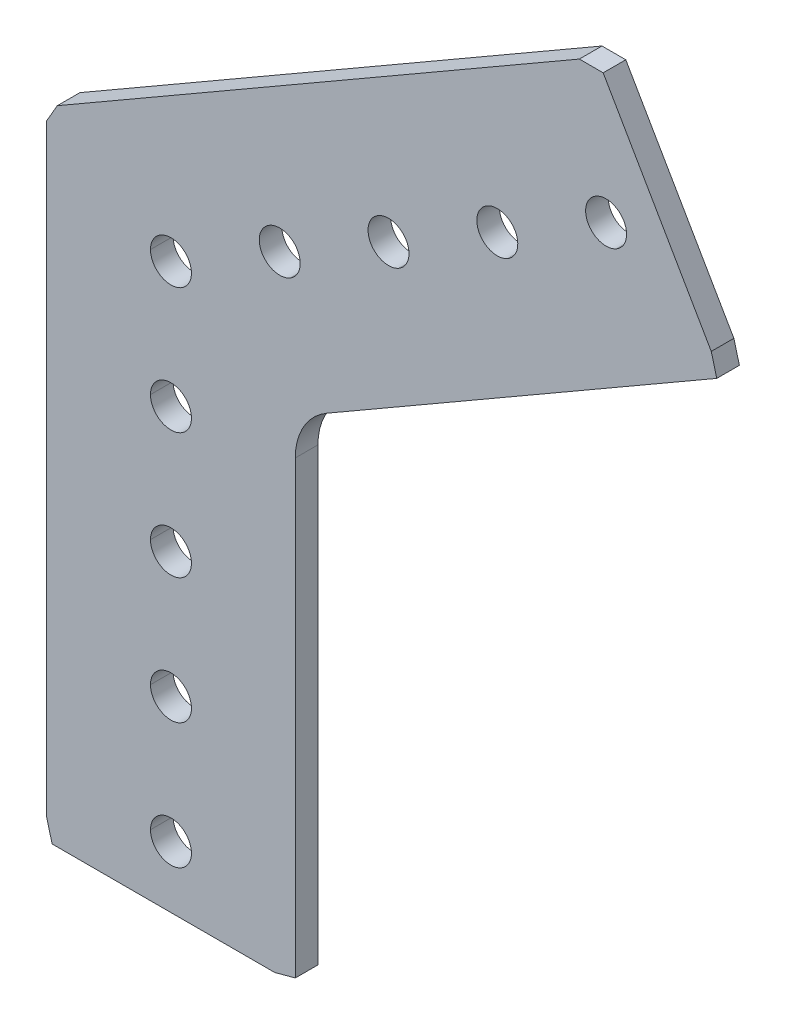
ISO-10303-21;
HEADER;
FILE_DESCRIPTION(('STEP AP214'),'2;1');
FILE_NAME('part.step','',(''),(''),'','','');
FILE_SCHEMA(('AUTOMOTIVE_DESIGN { 1 0 10303 214 1 1 1 1 }'));
ENDSEC;
DATA;
#1=APPLICATION_CONTEXT('core data for automotive mechanical design processes');
#2=APPLICATION_PROTOCOL_DEFINITION('international standard','automotive_design',2000,#1);
#3=PRODUCT_CONTEXT('',#1,'mechanical');
#4=PRODUCT('Part','Part','',(#3));
#5=PRODUCT_RELATED_PRODUCT_CATEGORY('part','',(#4));
#6=PRODUCT_DEFINITION_FORMATION('','',#4);
#7=PRODUCT_DEFINITION_CONTEXT('part definition',#1,'design');
#8=PRODUCT_DEFINITION('design','',#6,#7);
#9=PRODUCT_DEFINITION_SHAPE('','',#8);
#10=(LENGTH_UNIT() NAMED_UNIT(*) SI_UNIT(.MILLI.,.METRE.));
#11=(NAMED_UNIT(*) PLANE_ANGLE_UNIT() SI_UNIT($,.RADIAN.));
#12=(NAMED_UNIT(*) SI_UNIT($,.STERADIAN.) SOLID_ANGLE_UNIT());
#13=UNCERTAINTY_MEASURE_WITH_UNIT(LENGTH_MEASURE(1.E-05),#10,'distance_accuracy_value','');
#14=(GEOMETRIC_REPRESENTATION_CONTEXT(3) GLOBAL_UNCERTAINTY_ASSIGNED_CONTEXT((#13)) GLOBAL_UNIT_ASSIGNED_CONTEXT((#10,
#11,#12)) REPRESENTATION_CONTEXT('',''));
#15=CARTESIAN_POINT('',(0.,0.,0.));
#16=DIRECTION('',(0.,0.,1.));
#17=DIRECTION('',(1.,0.,0.));
#18=AXIS2_PLACEMENT_3D('',#15,#16,#17);
#19=CARTESIAN_POINT('',(-12.573,-54.9375661410419,2.286));
#20=DIRECTION('',(0.965925826289068,0.258819045102523,0.));
#21=DIRECTION('',(0.,0.,-1.));
#22=AXIS2_PLACEMENT_3D('',#19,#20,#21);
#23=PLANE('',#22);
#24=DIRECTION('',(-0.258819045102523,0.965925826289068,0.));
#25=VECTOR('',#24,1.);
#26=CARTESIAN_POINT('',(-12.573,-54.9375661410419,2.286));
#27=LINE('',#26,#25);
#28=CARTESIAN_POINT('',(-12.0142096816237,-57.023,2.286));
#29=VERTEX_POINT('',#28);
#30=CARTESIAN_POINT('',(-12.573,-54.9375661410419,2.286));
#31=VERTEX_POINT('',#30);
#32=EDGE_CURVE('E267',#29,#31,#27,.T.);
#33=ORIENTED_EDGE('',*,*,#32,.T.);
#34=DIRECTION('',(0.,0.,-1.));
#35=VECTOR('',#34,1.);
#36=CARTESIAN_POINT('',(-12.573,-54.9375661410419,2.286));
#37=LINE('',#36,#35);
#38=CARTESIAN_POINT('',(-12.573,-54.9375661410419,0.));
#39=VERTEX_POINT('',#38);
#40=EDGE_CURVE('E501',#31,#39,#37,.T.);
#41=ORIENTED_EDGE('',*,*,#40,.T.);
#42=DIRECTION('',(-0.258819045102523,0.965925826289068,0.));
#43=VECTOR('',#42,1.);
#44=CARTESIAN_POINT('',(-12.573,-54.9375661410419,0.));
#45=LINE('',#44,#43);
#46=CARTESIAN_POINT('',(-12.0142096816237,-57.023,0.));
#47=VERTEX_POINT('',#46);
#48=EDGE_CURVE('E328',#47,#39,#45,.T.);
#49=ORIENTED_EDGE('',*,*,#48,.F.);
#50=DIRECTION('',(0.,0.,-1.));
#51=VECTOR('',#50,1.);
#52=CARTESIAN_POINT('',(-12.0142096816237,-57.023,2.286));
#53=LINE('',#52,#51);
#54=EDGE_CURVE('E253',#29,#47,#53,.T.);
#55=ORIENTED_EDGE('',*,*,#54,.F.);
#56=EDGE_LOOP('',(#33,#41,#49,#55));
#57=FACE_BOUND('',#56,.T.);
#58=ADVANCED_FACE('F14',(#57),#23,.F.);
#59=CARTESIAN_POINT('',(54.6271496705208,19.4290012979886,2.286));
#60=DIRECTION('',(-0.965925826289067,-0.258819045102525,0.));
#61=DIRECTION('',(-0.258819045102525,0.965925826289067,0.));
#62=AXIS2_PLACEMENT_3D('',#59,#60,#61);
#63=PLANE('',#62);
#64=DIRECTION('',(0.258819045102525,-0.965925826289067,0.));
#65=VECTOR('',#64,1.);
#66=CARTESIAN_POINT('',(54.6271496705208,19.4290012979886,2.286));
#67=LINE('',#66,#65);
#68=CARTESIAN_POINT('',(54.6271496705208,19.4290012979886,2.286));
#69=VERTEX_POINT('',#68);
#70=CARTESIAN_POINT('',(55.1859399888972,17.3435674390306,2.286));
#71=VERTEX_POINT('',#70);
#72=EDGE_CURVE('E473',#69,#71,#67,.T.);
#73=ORIENTED_EDGE('',*,*,#72,.T.);
#74=DIRECTION('',(0.,0.,-1.));
#75=VECTOR('',#74,1.);
#76=CARTESIAN_POINT('',(55.1859399888972,17.3435674390306,2.286));
#77=LINE('',#76,#75);
#78=CARTESIAN_POINT('',(55.1859399888972,17.3435674390306,0.));
#79=VERTEX_POINT('',#78);
#80=EDGE_CURVE('E305',#71,#79,#77,.T.);
#81=ORIENTED_EDGE('',*,*,#80,.T.);
#82=DIRECTION('',(0.258819045102525,-0.965925826289067,0.));
#83=VECTOR('',#82,1.);
#84=CARTESIAN_POINT('',(54.6271496705208,19.4290012979886,0.));
#85=LINE('',#84,#83);
#86=CARTESIAN_POINT('',(54.6271496705208,19.4290012979886,0.));
#87=VERTEX_POINT('',#86);
#88=EDGE_CURVE('E376',#87,#79,#85,.T.);
#89=ORIENTED_EDGE('',*,*,#88,.F.);
#90=DIRECTION('',(0.,0.,-1.));
#91=VECTOR('',#90,1.);
#92=CARTESIAN_POINT('',(54.6271496705208,19.4290012979886,2.286));
#93=LINE('',#92,#91);
#94=EDGE_CURVE('E252',#69,#87,#93,.T.);
#95=ORIENTED_EDGE('',*,*,#94,.F.);
#96=EDGE_LOOP('',(#73,#81,#89,#95));
#97=FACE_BOUND('',#96,.T.);
#98=ADVANCED_FACE('F614',(#97),#63,.F.);
#99=CARTESIAN_POINT('',(41.2908279002298,38.3573204723031,2.286));
#100=DIRECTION('',(0.,-1.,0.));
#101=DIRECTION('',(0.,0.,-1.));
#102=AXIS2_PLACEMENT_3D('',#99,#100,#101);
#103=PLANE('',#102);
#104=DIRECTION('',(1.,0.,0.));
#105=VECTOR('',#104,1.);
#106=CARTESIAN_POINT('',(41.2908279002298,38.3573204723031,2.286));
#107=LINE('',#106,#105);
#108=CARTESIAN_POINT('',(41.2908279002298,38.3573204723031,2.286));
#109=VERTEX_POINT('',#108);
#110=CARTESIAN_POINT('',(43.6988794999231,38.3573204723031,2.286));
#111=VERTEX_POINT('',#110);
#112=EDGE_CURVE('E296',#109,#111,#107,.T.);
#113=ORIENTED_EDGE('',*,*,#112,.T.);
#114=DIRECTION('',(0.,0.,-1.));
#115=VECTOR('',#114,1.);
#116=CARTESIAN_POINT('',(43.6988794999231,38.3573204723031,2.286));
#117=LINE('',#116,#115);
#118=CARTESIAN_POINT('',(43.6988794999231,38.3573204723031,0.));
#119=VERTEX_POINT('',#118);
#120=EDGE_CURVE('E309',#111,#119,#117,.T.);
#121=ORIENTED_EDGE('',*,*,#120,.T.);
#122=DIRECTION('',(1.,0.,0.));
#123=VECTOR('',#122,1.);
#124=CARTESIAN_POINT('',(0.,38.3573204723031,0.));
#125=LINE('',#124,#123);
#126=CARTESIAN_POINT('',(41.2908279002298,38.3573204723031,0.));
#127=VERTEX_POINT('',#126);
#128=EDGE_CURVE('E342',#127,#119,#125,.T.);
#129=ORIENTED_EDGE('',*,*,#128,.F.);
#130=DIRECTION('',(0.,0.,-1.));
#131=VECTOR('',#130,1.);
#132=CARTESIAN_POINT('',(41.2908279002298,38.3573204723031,2.286));
#133=LINE('',#132,#131);
#134=EDGE_CURVE('E456',#109,#127,#133,.T.);
#135=ORIENTED_EDGE('',*,*,#134,.F.);
#136=EDGE_LOOP('',(#113,#121,#129,#135));
#137=FACE_BOUND('',#136,.T.);
#138=ADVANCED_FACE('F752',(#137),#103,.F.);
#139=CARTESIAN_POINT('',(-12.573,6.01252570334088,2.286));
#140=DIRECTION('',(0.866025403784439,-0.5,0.));
#141=DIRECTION('',(0.,0.,-1.));
#142=AXIS2_PLACEMENT_3D('',#139,#140,#141);
#143=PLANE('',#142);
#144=DIRECTION('',(0.5,0.866025403784439,0.));
#145=VECTOR('',#144,1.);
#146=CARTESIAN_POINT('',(-12.573,6.01252570334088,2.286));
#147=LINE('',#146,#145);
#148=CARTESIAN_POINT('',(-12.573,6.01252570334088,2.286));
#149=VERTEX_POINT('',#148);
#150=CARTESIAN_POINT('',(-11.4935,7.88227455011124,2.286));
#151=VERTEX_POINT('',#150);
#152=EDGE_CURVE('E295',#149,#151,#147,.T.);
#153=ORIENTED_EDGE('',*,*,#152,.T.);
#154=DIRECTION('',(0.,0.,-1.));
#155=VECTOR('',#154,1.);
#156=CARTESIAN_POINT('',(-11.4935,7.88227455011131,2.286));
#157=LINE('',#156,#155);
#158=CARTESIAN_POINT('',(-11.4935,7.88227455011131,0.));
#159=VERTEX_POINT('',#158);
#160=EDGE_CURVE('E498',#151,#159,#157,.T.);
#161=ORIENTED_EDGE('',*,*,#160,.T.);
#162=DIRECTION('',(0.5,0.866025403784439,0.));
#163=VECTOR('',#162,1.);
#164=CARTESIAN_POINT('',(-12.573,6.01252570334088,0.));
#165=LINE('',#164,#163);
#166=CARTESIAN_POINT('',(-12.573,6.01252570334088,0.));
#167=VERTEX_POINT('',#166);
#168=EDGE_CURVE('E343',#167,#159,#165,.T.);
#169=ORIENTED_EDGE('',*,*,#168,.F.);
#170=DIRECTION('',(0.,0.,-1.));
#171=VECTOR('',#170,1.);
#172=CARTESIAN_POINT('',(-12.573,6.01252570334088,2.286));
#173=LINE('',#172,#171);
#174=EDGE_CURVE('E18',#149,#167,#173,.T.);
#175=ORIENTED_EDGE('',*,*,#174,.F.);
#176=EDGE_LOOP('',(#153,#161,#169,#175));
#177=FACE_BOUND('',#176,.T.);
#178=ADVANCED_FACE('F747',(#177),#143,.F.);
#179=CARTESIAN_POINT('',(10.4875661410419,-57.023,2.286));
#180=DIRECTION('',(-0.258819045102521,0.965925826289068,0.));
#181=DIRECTION('',(0.,0.,1.));
#182=AXIS2_PLACEMENT_3D('',#179,#180,#181);
#183=PLANE('',#182);
#184=DIRECTION('',(-0.965925826289068,-0.258819045102521,0.));
#185=VECTOR('',#184,1.);
#186=CARTESIAN_POINT('',(10.4875661410419,-57.023,2.286));
#187=LINE('',#186,#185);
#188=CARTESIAN_POINT('',(12.573,-56.4642096816236,2.286));
#189=VERTEX_POINT('',#188);
#190=CARTESIAN_POINT('',(10.4875661410419,-57.023,2.286));
#191=VERTEX_POINT('',#190);
#192=EDGE_CURVE('E256',#189,#191,#187,.T.);
#193=ORIENTED_EDGE('',*,*,#192,.T.);
#194=DIRECTION('',(0.,0.,-1.));
#195=VECTOR('',#194,1.);
#196=CARTESIAN_POINT('',(10.4875661410419,-57.023,2.286));
#197=LINE('',#196,#195);
#198=CARTESIAN_POINT('',(10.4875661410419,-57.023,0.));
#199=VERTEX_POINT('',#198);
#200=EDGE_CURVE('E40',#191,#199,#197,.T.);
#201=ORIENTED_EDGE('',*,*,#200,.T.);
#202=DIRECTION('',(-0.965925826289068,-0.258819045102521,0.));
#203=VECTOR('',#202,1.);
#204=CARTESIAN_POINT('',(10.4875661410419,-57.023,0.));
#205=LINE('',#204,#203);
#206=CARTESIAN_POINT('',(12.573,-56.4642096816236,0.));
#207=VERTEX_POINT('',#206);
#208=EDGE_CURVE('E382',#207,#199,#205,.T.);
#209=ORIENTED_EDGE('',*,*,#208,.F.);
#210=DIRECTION('',(0.,0.,-1.));
#211=VECTOR('',#210,1.);
#212=CARTESIAN_POINT('',(12.573,-56.4642096816236,2.286));
#213=LINE('',#212,#211);
#214=EDGE_CURVE('E25',#189,#207,#213,.T.);
#215=ORIENTED_EDGE('',*,*,#214,.F.);
#216=EDGE_LOOP('',(#193,#201,#209,#215));
#217=FACE_BOUND('',#216,.T.);
#218=ADVANCED_FACE('F257',(#217),#183,.F.);
#219=CARTESIAN_POINT('',(18.923,-10.9251991438752,2.286));
#220=DIRECTION('',(0.,0.,1.));
#221=DIRECTION('',(1.,0.,0.));
#222=AXIS2_PLACEMENT_3D('',#219,#220,#221);
#223=CYLINDRICAL_SURFACE('',#222,6.35);
#224=CARTESIAN_POINT('',(18.923,-10.9251991438752,2.286));
#225=DIRECTION('',(0.,0.,-1.));
#226=DIRECTION('',(1.,0.,0.));
#227=AXIS2_PLACEMENT_3D('',#224,#225,#226);
#228=CIRCLE('',#227,6.35);
#229=CARTESIAN_POINT('',(12.573,-10.9251991438752,2.286));
#230=VERTEX_POINT('',#229);
#231=CARTESIAN_POINT('',(15.748,-5.42593782984402,2.286));
#232=VERTEX_POINT('',#231);
#233=EDGE_CURVE('E358',#230,#232,#228,.T.);
#234=ORIENTED_EDGE('',*,*,#233,.F.);
#235=DIRECTION('',(0.,0.,1.));
#236=VECTOR('',#235,1.);
#237=CARTESIAN_POINT('',(12.573,-10.9251991438752,2.286));
#238=LINE('',#237,#236);
#239=CARTESIAN_POINT('',(12.573,-10.9251991438752,0.));
#240=VERTEX_POINT('',#239);
#241=EDGE_CURVE('E9',#240,#230,#238,.T.);
#242=ORIENTED_EDGE('',*,*,#241,.F.);
#243=CARTESIAN_POINT('',(18.923,-10.9251991438752,0.));
#244=DIRECTION('',(0.,0.,1.));
#245=DIRECTION('',(1.,0.,0.));
#246=AXIS2_PLACEMENT_3D('',#243,#244,#245);
#247=CIRCLE('',#246,6.35);
#248=CARTESIAN_POINT('',(15.748,-5.42593782984402,0.));
#249=VERTEX_POINT('',#248);
#250=EDGE_CURVE('E419',#249,#240,#247,.T.);
#251=ORIENTED_EDGE('',*,*,#250,.F.);
#252=DIRECTION('',(0.,0.,-1.));
#253=VECTOR('',#252,1.);
#254=CARTESIAN_POINT('',(15.748,-5.42593782984402,0.));
#255=LINE('',#254,#253);
#256=EDGE_CURVE('E308',#232,#249,#255,.T.);
#257=ORIENTED_EDGE('',*,*,#256,.F.);
#258=EDGE_LOOP('',(#234,#242,#251,#257));
#259=FACE_BOUND('',#258,.T.);
#260=ADVANCED_FACE('F801',(#259),#223,.F.);
#261=CARTESIAN_POINT('',(43.9940905122493,25.4000000000004,2.286));
#262=DIRECTION('',(0.,0.,-1.));
#263=DIRECTION('',(-0.500000000000008,0.866025403784434,0.));
#264=AXIS2_PLACEMENT_3D('',#261,#262,#263);
#265=CYLINDRICAL_SURFACE('',#264,2.0701);
#266=DIRECTION('',(0.,0.,-1.));
#267=VECTOR('',#266,1.);
#268=CARTESIAN_POINT('',(45.0291405122493,23.6072408116262,2.286));
#269=LINE('',#268,#267);
#270=CARTESIAN_POINT('',(45.0291405122493,23.6072408116262,2.286));
#271=VERTEX_POINT('',#270);
#272=CARTESIAN_POINT('',(45.0291405122493,23.6072408116262,0.));
#273=VERTEX_POINT('',#272);
#274=EDGE_CURVE('E367',#271,#273,#269,.T.);
#275=ORIENTED_EDGE('',*,*,#274,.F.);
#276=CARTESIAN_POINT('',(43.9940905122493,25.4000000000004,2.286));
#277=DIRECTION('',(0.,0.,-1.));
#278=DIRECTION('',(0.500000000000008,-0.866025403784434,0.));
#279=AXIS2_PLACEMENT_3D('',#276,#277,#278);
#280=CIRCLE('',#279,2.0701);
#281=CARTESIAN_POINT('',(42.9590405122492,27.1927591883745,2.286));
#282=VERTEX_POINT('',#281);
#283=EDGE_CURVE('E337',#282,#271,#280,.T.);
#284=ORIENTED_EDGE('',*,*,#283,.F.);
#285=DIRECTION('',(0.,0.,-1.));
#286=VECTOR('',#285,1.);
#287=CARTESIAN_POINT('',(42.9590405122492,27.1927591883745,2.286));
#288=LINE('',#287,#286);
#289=CARTESIAN_POINT('',(42.9590405122492,27.1927591883745,0.));
#290=VERTEX_POINT('',#289);
#291=EDGE_CURVE('E513',#282,#290,#288,.T.);
#292=ORIENTED_EDGE('',*,*,#291,.T.);
#293=CARTESIAN_POINT('',(43.9940905122493,25.4000000000004,0.));
#294=DIRECTION('',(0.,0.,-1.));
#295=DIRECTION('',(0.500000000000008,-0.866025403784434,0.));
#296=AXIS2_PLACEMENT_3D('',#293,#294,#295);
#297=CIRCLE('',#296,2.0701);
#298=EDGE_CURVE('E327',#290,#273,#297,.T.);
#299=ORIENTED_EDGE('',*,*,#298,.T.);
#300=EDGE_LOOP('',(#275,#284,#292,#299));
#301=FACE_BOUND('',#300,.T.);
#302=ADVANCED_FACE('F572',(#301),#265,.F.);
#303=CARTESIAN_POINT('',(32.9955678841872,19.05,2.286));
#304=DIRECTION('',(0.,0.,-1.));
#305=DIRECTION('',(-0.500000000000008,0.866025403784434,0.));
#306=AXIS2_PLACEMENT_3D('',#303,#304,#305);
#307=CYLINDRICAL_SURFACE('',#306,2.0701);
#308=DIRECTION('',(0.,0.,-1.));
#309=VECTOR('',#308,1.);
#310=CARTESIAN_POINT('',(34.0306178841872,17.2572408116258,2.286));
#311=LINE('',#310,#309);
#312=CARTESIAN_POINT('',(34.0306178841872,17.2572408116258,2.286));
#313=VERTEX_POINT('',#312);
#314=CARTESIAN_POINT('',(34.0306178841872,17.2572408116258,0.));
#315=VERTEX_POINT('',#314);
#316=EDGE_CURVE('E512',#313,#315,#311,.T.);
#317=ORIENTED_EDGE('',*,*,#316,.F.);
#318=CARTESIAN_POINT('',(32.9955678841872,19.05,2.286));
#319=DIRECTION('',(0.,0.,-1.));
#320=DIRECTION('',(0.500000000000008,-0.866025403784434,0.));
#321=AXIS2_PLACEMENT_3D('',#318,#319,#320);
#322=CIRCLE('',#321,2.0701);
#323=CARTESIAN_POINT('',(31.9605178841871,20.8427591883741,2.286));
#324=VERTEX_POINT('',#323);
#325=EDGE_CURVE('E301',#324,#313,#322,.T.);
#326=ORIENTED_EDGE('',*,*,#325,.F.);
#327=DIRECTION('',(0.,0.,-1.));
#328=VECTOR('',#327,1.);
#329=CARTESIAN_POINT('',(31.9605178841871,20.8427591883741,2.286));
#330=LINE('',#329,#328);
#331=CARTESIAN_POINT('',(31.9605178841871,20.8427591883741,0.));
#332=VERTEX_POINT('',#331);
#333=EDGE_CURVE('E386',#324,#332,#330,.T.);
#334=ORIENTED_EDGE('',*,*,#333,.T.);
#335=CARTESIAN_POINT('',(32.9955678841872,19.05,0.));
#336=DIRECTION('',(0.,0.,-1.));
#337=DIRECTION('',(0.500000000000008,-0.866025403784434,0.));
#338=AXIS2_PLACEMENT_3D('',#335,#336,#337);
#339=CIRCLE('',#338,2.0701);
#340=EDGE_CURVE('E432',#332,#315,#339,.T.);
#341=ORIENTED_EDGE('',*,*,#340,.T.);
#342=EDGE_LOOP('',(#317,#326,#334,#341));
#343=FACE_BOUND('',#342,.T.);
#344=ADVANCED_FACE('F823',(#343),#307,.F.);
#345=CARTESIAN_POINT('',(21.9970452561247,12.7,2.286));
#346=DIRECTION('',(0.,0.,-1.));
#347=DIRECTION('',(-0.500000000000006,0.866025403784435,0.));
#348=AXIS2_PLACEMENT_3D('',#345,#346,#347);
#349=CYLINDRICAL_SURFACE('',#348,2.0701);
#350=DIRECTION('',(0.,0.,-1.));
#351=VECTOR('',#350,1.);
#352=CARTESIAN_POINT('',(23.0320952561248,10.9072408116258,2.286));
#353=LINE('',#352,#351);
#354=CARTESIAN_POINT('',(23.0320952561248,10.9072408116258,2.286));
#355=VERTEX_POINT('',#354);
#356=CARTESIAN_POINT('',(23.0320952561248,10.9072408116258,0.));
#357=VERTEX_POINT('',#356);
#358=EDGE_CURVE('E357',#355,#357,#353,.T.);
#359=ORIENTED_EDGE('',*,*,#358,.F.);
#360=CARTESIAN_POINT('',(21.9970452561247,12.7,2.286));
#361=DIRECTION('',(0.,0.,-1.));
#362=DIRECTION('',(0.500000000000006,-0.866025403784435,0.));
#363=AXIS2_PLACEMENT_3D('',#360,#361,#362);
#364=CIRCLE('',#363,2.0701);
#365=CARTESIAN_POINT('',(20.9619952561248,14.4927591883741,2.286));
#366=VERTEX_POINT('',#365);
#367=EDGE_CURVE('E439',#366,#355,#364,.T.);
#368=ORIENTED_EDGE('',*,*,#367,.F.);
#369=DIRECTION('',(0.,0.,-1.));
#370=VECTOR('',#369,1.);
#371=CARTESIAN_POINT('',(20.9619952561248,14.4927591883741,2.286));
#372=LINE('',#371,#370);
#373=CARTESIAN_POINT('',(20.9619952561248,14.4927591883741,0.));
#374=VERTEX_POINT('',#373);
#375=EDGE_CURVE('E356',#366,#374,#372,.T.);
#376=ORIENTED_EDGE('',*,*,#375,.T.);
#377=CARTESIAN_POINT('',(21.9970452561247,12.7,0.));
#378=DIRECTION('',(0.,0.,-1.));
#379=DIRECTION('',(0.500000000000006,-0.866025403784435,0.));
#380=AXIS2_PLACEMENT_3D('',#377,#378,#379);
#381=CIRCLE('',#380,2.0701);
#382=EDGE_CURVE('E323',#374,#357,#381,.T.);
#383=ORIENTED_EDGE('',*,*,#382,.T.);
#384=EDGE_LOOP('',(#359,#368,#376,#383));
#385=FACE_BOUND('',#384,.T.);
#386=ADVANCED_FACE('F712',(#385),#349,.F.);
#387=CARTESIAN_POINT('',(10.9985226280624,6.35,2.286));
#388=DIRECTION('',(0.,0.,-1.));
#389=DIRECTION('',(-0.500000000000006,0.866025403784435,0.));
#390=AXIS2_PLACEMENT_3D('',#387,#388,#389);
#391=CYLINDRICAL_SURFACE('',#390,2.0701);
#392=DIRECTION('',(0.,0.,-1.));
#393=VECTOR('',#392,1.);
#394=CARTESIAN_POINT('',(12.0335726280624,4.55724081162581,2.286));
#395=LINE('',#394,#393);
#396=CARTESIAN_POINT('',(12.0335726280624,4.55724081162581,2.286));
#397=VERTEX_POINT('',#396);
#398=CARTESIAN_POINT('',(12.0335726280624,4.55724081162581,0.));
#399=VERTEX_POINT('',#398);
#400=EDGE_CURVE('E395',#397,#399,#395,.T.);
#401=ORIENTED_EDGE('',*,*,#400,.F.);
#402=CARTESIAN_POINT('',(10.9985226280624,6.35,2.286));
#403=DIRECTION('',(0.,0.,-1.));
#404=DIRECTION('',(0.500000000000006,-0.866025403784435,0.));
#405=AXIS2_PLACEMENT_3D('',#402,#403,#404);
#406=CIRCLE('',#405,2.0701);
#407=CARTESIAN_POINT('',(9.96347262806237,8.14275918837413,2.286));
#408=VERTEX_POINT('',#407);
#409=EDGE_CURVE('E442',#408,#397,#406,.T.);
#410=ORIENTED_EDGE('',*,*,#409,.F.);
#411=DIRECTION('',(0.,0.,-1.));
#412=VECTOR('',#411,1.);
#413=CARTESIAN_POINT('',(9.96347262806237,8.14275918837413,2.286));
#414=LINE('',#413,#412);
#415=CARTESIAN_POINT('',(9.96347262806237,8.14275918837413,0.));
#416=VERTEX_POINT('',#415);
#417=EDGE_CURVE('E404',#408,#416,#414,.T.);
#418=ORIENTED_EDGE('',*,*,#417,.T.);
#419=CARTESIAN_POINT('',(10.9985226280624,6.35,0.));
#420=DIRECTION('',(0.,0.,-1.));
#421=DIRECTION('',(0.500000000000006,-0.866025403784435,0.));
#422=AXIS2_PLACEMENT_3D('',#419,#420,#421);
#423=CIRCLE('',#422,2.0701);
#424=EDGE_CURVE('E326',#416,#399,#423,.T.);
#425=ORIENTED_EDGE('',*,*,#424,.T.);
#426=EDGE_LOOP('',(#401,#410,#418,#425));
#427=FACE_BOUND('',#426,.T.);
#428=ADVANCED_FACE('F706',(#427),#391,.F.);
#429=CARTESIAN_POINT('',(0.,-50.8,2.286));
#430=DIRECTION('',(0.,0.,-1.));
#431=DIRECTION('',(-1.,0.,0.));
#432=AXIS2_PLACEMENT_3D('',#429,#430,#431);
#433=CYLINDRICAL_SURFACE('',#432,2.0701);
#434=DIRECTION('',(0.,0.,-1.));
#435=VECTOR('',#434,1.);
#436=CARTESIAN_POINT('',(2.0701,-50.8,2.286));
#437=LINE('',#436,#435);
#438=CARTESIAN_POINT('',(2.0701,-50.8,2.286));
#439=VERTEX_POINT('',#438);
#440=CARTESIAN_POINT('',(2.0701,-50.8,0.));
#441=VERTEX_POINT('',#440);
#442=EDGE_CURVE('E429',#439,#441,#437,.T.);
#443=ORIENTED_EDGE('',*,*,#442,.F.);
#444=CARTESIAN_POINT('',(0.,-50.8,2.286));
#445=DIRECTION('',(0.,0.,1.));
#446=DIRECTION('',(1.,0.,0.));
#447=AXIS2_PLACEMENT_3D('',#444,#445,#446);
#448=CIRCLE('',#447,2.0701);
#449=CARTESIAN_POINT('',(-2.0701,-50.8,2.286));
#450=VERTEX_POINT('',#449);
#451=EDGE_CURVE('E297',#439,#450,#448,.T.);
#452=ORIENTED_EDGE('',*,*,#451,.T.);
#453=DIRECTION('',(0.,0.,-1.));
#454=VECTOR('',#453,1.);
#455=CARTESIAN_POINT('',(-2.0701,-50.8,2.286));
#456=LINE('',#455,#454);
#457=CARTESIAN_POINT('',(-2.0701,-50.8,0.));
#458=VERTEX_POINT('',#457);
#459=EDGE_CURVE('E286',#450,#458,#456,.T.);
#460=ORIENTED_EDGE('',*,*,#459,.T.);
#461=CARTESIAN_POINT('',(0.,-50.8,0.));
#462=DIRECTION('',(0.,0.,1.));
#463=DIRECTION('',(1.,0.,0.));
#464=AXIS2_PLACEMENT_3D('',#461,#462,#463);
#465=CIRCLE('',#464,2.0701);
#466=EDGE_CURVE('E320',#441,#458,#465,.T.);
#467=ORIENTED_EDGE('',*,*,#466,.F.);
#468=EDGE_LOOP('',(#443,#452,#460,#467));
#469=FACE_BOUND('',#468,.T.);
#470=ADVANCED_FACE('F711',(#469),#433,.F.);
#471=CARTESIAN_POINT('',(3.9907631702977E-13,-38.1,2.286));
#472=DIRECTION('',(0.,0.,-1.));
#473=DIRECTION('',(-1.,0.,0.));
#474=AXIS2_PLACEMENT_3D('',#471,#472,#473);
#475=CYLINDRICAL_SURFACE('',#474,2.0701);
#476=DIRECTION('',(0.,0.,-1.));
#477=VECTOR('',#476,1.);
#478=CARTESIAN_POINT('',(2.0701000000004,-38.1,2.286));
#479=LINE('',#478,#477);
#480=CARTESIAN_POINT('',(2.0701000000004,-38.1,2.286));
#481=VERTEX_POINT('',#480);
#482=CARTESIAN_POINT('',(2.0701000000004,-38.1,0.));
#483=VERTEX_POINT('',#482);
#484=EDGE_CURVE('E280',#481,#483,#479,.T.);
#485=ORIENTED_EDGE('',*,*,#484,.F.);
#486=CARTESIAN_POINT('',(3.9907631702977E-13,-38.1,2.286));
#487=DIRECTION('',(0.,0.,1.));
#488=DIRECTION('',(1.,0.,0.));
#489=AXIS2_PLACEMENT_3D('',#486,#487,#488);
#490=CIRCLE('',#489,2.0701);
#491=CARTESIAN_POINT('',(-2.0700999999996,-38.1,2.286));
#492=VERTEX_POINT('',#491);
#493=EDGE_CURVE('E517',#481,#492,#490,.T.);
#494=ORIENTED_EDGE('',*,*,#493,.T.);
#495=DIRECTION('',(0.,0.,-1.));
#496=VECTOR('',#495,1.);
#497=CARTESIAN_POINT('',(-2.0700999999996,-38.1,2.286));
#498=LINE('',#497,#496);
#499=CARTESIAN_POINT('',(-2.0700999999996,-38.1,0.));
#500=VERTEX_POINT('',#499);
#501=EDGE_CURVE('E371',#492,#500,#498,.T.);
#502=ORIENTED_EDGE('',*,*,#501,.T.);
#503=CARTESIAN_POINT('',(3.9907631702977E-13,-38.1,0.));
#504=DIRECTION('',(0.,0.,1.));
#505=DIRECTION('',(1.,0.,0.));
#506=AXIS2_PLACEMENT_3D('',#503,#504,#505);
#507=CIRCLE('',#506,2.0701);
#508=EDGE_CURVE('E278',#483,#500,#507,.T.);
#509=ORIENTED_EDGE('',*,*,#508,.F.);
#510=EDGE_LOOP('',(#485,#494,#502,#509));
#511=FACE_BOUND('',#510,.T.);
#512=ADVANCED_FACE('F945',(#511),#475,.F.);
#513=CARTESIAN_POINT('',(2.66050878019847E-13,-25.4,2.286));
#514=DIRECTION('',(0.,0.,-1.));
#515=DIRECTION('',(-1.,0.,0.));
#516=AXIS2_PLACEMENT_3D('',#513,#514,#515);
#517=CYLINDRICAL_SURFACE('',#516,2.0701);
#518=DIRECTION('',(0.,0.,-1.));
#519=VECTOR('',#518,1.);
#520=CARTESIAN_POINT('',(2.07010000000027,-25.4,2.286));
#521=LINE('',#520,#519);
#522=CARTESIAN_POINT('',(2.07010000000027,-25.4,2.286));
#523=VERTEX_POINT('',#522);
#524=CARTESIAN_POINT('',(2.07010000000027,-25.4,0.));
#525=VERTEX_POINT('',#524);
#526=EDGE_CURVE('E433',#523,#525,#521,.T.);
#527=ORIENTED_EDGE('',*,*,#526,.F.);
#528=CARTESIAN_POINT('',(2.66050878019847E-13,-25.4,2.286));
#529=DIRECTION('',(0.,0.,1.));
#530=DIRECTION('',(1.,0.,0.));
#531=AXIS2_PLACEMENT_3D('',#528,#529,#530);
#532=CIRCLE('',#531,2.0701);
#533=CARTESIAN_POINT('',(-2.07009999999973,-25.4,2.286));
#534=VERTEX_POINT('',#533);
#535=EDGE_CURVE('E300',#523,#534,#532,.T.);
#536=ORIENTED_EDGE('',*,*,#535,.T.);
#537=DIRECTION('',(0.,0.,-1.));
#538=VECTOR('',#537,1.);
#539=CARTESIAN_POINT('',(-2.07009999999973,-25.4,2.286));
#540=LINE('',#539,#538);
#541=CARTESIAN_POINT('',(-2.07009999999973,-25.4,0.));
#542=VERTEX_POINT('',#541);
#543=EDGE_CURVE('E449',#534,#542,#540,.T.);
#544=ORIENTED_EDGE('',*,*,#543,.T.);
#545=CARTESIAN_POINT('',(2.66050878019847E-13,-25.4,0.));
#546=DIRECTION('',(0.,0.,1.));
#547=DIRECTION('',(1.,0.,0.));
#548=AXIS2_PLACEMENT_3D('',#545,#546,#547);
#549=CIRCLE('',#548,2.0701);
#550=EDGE_CURVE('E316',#525,#542,#549,.T.);
#551=ORIENTED_EDGE('',*,*,#550,.F.);
#552=EDGE_LOOP('',(#527,#536,#544,#551));
#553=FACE_BOUND('',#552,.T.);
#554=ADVANCED_FACE('F546',(#553),#517,.F.);
#555=CARTESIAN_POINT('',(1.33025439009923E-13,-12.7,2.286));
#556=DIRECTION('',(0.,0.,-1.));
#557=DIRECTION('',(-1.,0.,0.));
#558=AXIS2_PLACEMENT_3D('',#555,#556,#557);
#559=CYLINDRICAL_SURFACE('',#558,2.0701);
#560=DIRECTION('',(0.,0.,-1.));
#561=VECTOR('',#560,1.);
#562=CARTESIAN_POINT('',(2.07010000000014,-12.7,2.286));
#563=LINE('',#562,#561);
#564=CARTESIAN_POINT('',(2.07010000000014,-12.7,2.286));
#565=VERTEX_POINT('',#564);
#566=CARTESIAN_POINT('',(2.07010000000014,-12.7,0.));
#567=VERTEX_POINT('',#566);
#568=EDGE_CURVE('E346',#565,#567,#563,.T.);
#569=ORIENTED_EDGE('',*,*,#568,.F.);
#570=CARTESIAN_POINT('',(1.33025439009923E-13,-12.7,2.286));
#571=DIRECTION('',(0.,0.,1.));
#572=DIRECTION('',(1.,0.,0.));
#573=AXIS2_PLACEMENT_3D('',#570,#571,#572);
#574=CIRCLE('',#573,2.0701);
#575=CARTESIAN_POINT('',(-2.07009999999987,-12.7,2.286));
#576=VERTEX_POINT('',#575);
#577=EDGE_CURVE('E448',#565,#576,#574,.T.);
#578=ORIENTED_EDGE('',*,*,#577,.T.);
#579=DIRECTION('',(0.,0.,-1.));
#580=VECTOR('',#579,1.);
#581=CARTESIAN_POINT('',(-2.07009999999987,-12.7,2.286));
#582=LINE('',#581,#580);
#583=CARTESIAN_POINT('',(-2.07009999999987,-12.7,0.));
#584=VERTEX_POINT('',#583);
#585=EDGE_CURVE('E414',#576,#584,#582,.T.);
#586=ORIENTED_EDGE('',*,*,#585,.T.);
#587=CARTESIAN_POINT('',(1.33025439009923E-13,-12.7,0.));
#588=DIRECTION('',(0.,0.,1.));
#589=DIRECTION('',(1.,0.,0.));
#590=AXIS2_PLACEMENT_3D('',#587,#588,#589);
#591=CIRCLE('',#590,2.0701);
#592=EDGE_CURVE('E319',#567,#584,#591,.T.);
#593=ORIENTED_EDGE('',*,*,#592,.F.);
#594=EDGE_LOOP('',(#569,#578,#586,#593));
#595=FACE_BOUND('',#594,.T.);
#596=ADVANCED_FACE('F812',(#595),#559,.F.);
#597=CARTESIAN_POINT('',(0.,0.,2.286));
#598=DIRECTION('',(0.,0.,-1.));
#599=DIRECTION('',(-1.,0.,0.));
#600=AXIS2_PLACEMENT_3D('',#597,#598,#599);
#601=CYLINDRICAL_SURFACE('',#600,2.0701);
#602=DIRECTION('',(0.,0.,-1.));
#603=VECTOR('',#602,1.);
#604=CARTESIAN_POINT('',(2.0701,0.,2.286));
#605=LINE('',#604,#603);
#606=CARTESIAN_POINT('',(2.0701,0.,2.286));
#607=VERTEX_POINT('',#606);
#608=CARTESIAN_POINT('',(2.0701,0.,0.));
#609=VERTEX_POINT('',#608);
#610=EDGE_CURVE('E314',#607,#609,#605,.T.);
#611=ORIENTED_EDGE('',*,*,#610,.F.);
#612=CARTESIAN_POINT('',(0.,0.,2.286));
#613=DIRECTION('',(0.,0.,-1.));
#614=DIRECTION('',(1.,0.,0.));
#615=AXIS2_PLACEMENT_3D('',#612,#613,#614);
#616=CIRCLE('',#615,2.0701);
#617=CARTESIAN_POINT('',(-2.0701,0.,2.286));
#618=VERTEX_POINT('',#617);
#619=EDGE_CURVE('E333',#618,#607,#616,.T.);
#620=ORIENTED_EDGE('',*,*,#619,.F.);
#621=DIRECTION('',(0.,0.,-1.));
#622=VECTOR('',#621,1.);
#623=CARTESIAN_POINT('',(-2.0701,0.,2.286));
#624=LINE('',#623,#622);
#625=CARTESIAN_POINT('',(-2.0701,0.,0.));
#626=VERTEX_POINT('',#625);
#627=EDGE_CURVE('E313',#618,#626,#624,.T.);
#628=ORIENTED_EDGE('',*,*,#627,.T.);
#629=CARTESIAN_POINT('',(0.,0.,0.));
#630=DIRECTION('',(0.,0.,-1.));
#631=DIRECTION('',(1.,0.,0.));
#632=AXIS2_PLACEMENT_3D('',#629,#630,#631);
#633=CIRCLE('',#632,2.0701);
#634=EDGE_CURVE('E504',#626,#609,#633,.T.);
#635=ORIENTED_EDGE('',*,*,#634,.T.);
#636=EDGE_LOOP('',(#611,#620,#628,#635));
#637=FACE_BOUND('',#636,.T.);
#638=ADVANCED_FACE('F631',(#637),#601,.F.);
#639=CARTESIAN_POINT('',(12.573,-7.25902493452115,2.286));
#640=DIRECTION('',(-1.,0.,0.));
#641=DIRECTION('',(0.,0.,1.));
#642=AXIS2_PLACEMENT_3D('',#639,#640,#641);
#643=PLANE('',#642);
#644=ORIENTED_EDGE('',*,*,#214,.T.);
#645=DIRECTION('',(0.,1.,0.));
#646=VECTOR('',#645,1.);
#647=CARTESIAN_POINT('',(12.573,-7.25902493452115,0.));
#648=LINE('',#647,#646);
#649=EDGE_CURVE('E385',#207,#240,#648,.T.);
#650=ORIENTED_EDGE('',*,*,#649,.T.);
#651=ORIENTED_EDGE('',*,*,#241,.T.);
#652=DIRECTION('',(0.,1.,0.));
#653=VECTOR('',#652,1.);
#654=CARTESIAN_POINT('',(12.573,-7.25902493452115,2.286));
#655=LINE('',#654,#653);
#656=EDGE_CURVE('E262',#189,#230,#655,.T.);
#657=ORIENTED_EDGE('',*,*,#656,.F.);
#658=EDGE_LOOP('',(#644,#650,#651,#657));
#659=FACE_BOUND('',#658,.T.);
#660=ADVANCED_FACE('F783',(#659),#643,.F.);
#661=CARTESIAN_POINT('',(43.0968665999997,39.4000374017821,2.286));
#662=DIRECTION('',(0.500000000000007,-0.866025403784435,0.));
#663=DIRECTION('',(0.,0.,-1.));
#664=AXIS2_PLACEMENT_3D('',#661,#662,#663);
#665=PLANE('',#664);
#666=ORIENTED_EDGE('',*,*,#134,.T.);
#667=DIRECTION('',(0.866025403784435,0.500000000000007,0.));
#668=VECTOR('',#667,1.);
#669=CARTESIAN_POINT('',(43.0968665999997,39.4000374017821,0.));
#670=LINE('',#669,#668);
#671=EDGE_CURVE('E338',#159,#127,#670,.T.);
#672=ORIENTED_EDGE('',*,*,#671,.F.);
#673=ORIENTED_EDGE('',*,*,#160,.F.);
#674=DIRECTION('',(0.866025403784435,0.500000000000007,0.));
#675=VECTOR('',#674,1.);
#676=CARTESIAN_POINT('',(43.0968665999997,39.4000374017821,2.286));
#677=LINE('',#676,#675);
#678=EDGE_CURVE('E291',#151,#109,#677,.T.);
#679=ORIENTED_EDGE('',*,*,#678,.T.);
#680=EDGE_LOOP('',(#666,#672,#673,#679));
#681=FACE_BOUND('',#680,.T.);
#682=ADVANCED_FACE('F788',(#681),#665,.F.);
#683=CARTESIAN_POINT('',(12.573,-7.25902493452107,2.286));
#684=DIRECTION('',(-0.500000000000007,0.866025403784435,0.));
#685=DIRECTION('',(0.,0.,1.));
#686=AXIS2_PLACEMENT_3D('',#683,#684,#685);
#687=PLANE('',#686);
#688=ORIENTED_EDGE('',*,*,#80,.F.);
#689=DIRECTION('',(-0.866025403784435,-0.500000000000007,0.));
#690=VECTOR('',#689,1.);
#691=CARTESIAN_POINT('',(12.573,-7.25902493452107,2.286));
#692=LINE('',#691,#690);
#693=EDGE_CURVE('E362',#71,#232,#692,.T.);
#694=ORIENTED_EDGE('',*,*,#693,.T.);
#695=ORIENTED_EDGE('',*,*,#256,.T.);
#696=DIRECTION('',(-0.866025403784435,-0.500000000000007,0.));
#697=VECTOR('',#696,1.);
#698=CARTESIAN_POINT('',(12.573,-7.25902493452107,0.));
#699=LINE('',#698,#697);
#700=EDGE_CURVE('E380',#79,#249,#699,.T.);
#701=ORIENTED_EDGE('',*,*,#700,.F.);
#702=EDGE_LOOP('',(#688,#694,#695,#701));
#703=FACE_BOUND('',#702,.T.);
#704=ADVANCED_FACE('F846',(#703),#687,.F.);
#705=CARTESIAN_POINT('',(55.6698665999999,17.6229625982187,2.286));
#706=DIRECTION('',(-0.866025403784435,-0.500000000000007,0.));
#707=DIRECTION('',(-0.500000000000007,0.866025403784435,0.));
#708=AXIS2_PLACEMENT_3D('',#705,#706,#707);
#709=PLANE('',#708);
#710=ORIENTED_EDGE('',*,*,#94,.T.);
#711=DIRECTION('',(0.500000000000007,-0.866025403784435,0.));
#712=VECTOR('',#711,1.);
#713=CARTESIAN_POINT('',(55.6698665999999,17.6229625982187,0.));
#714=LINE('',#713,#712);
#715=EDGE_CURVE('E381',#119,#87,#714,.T.);
#716=ORIENTED_EDGE('',*,*,#715,.F.);
#717=ORIENTED_EDGE('',*,*,#120,.F.);
#718=DIRECTION('',(0.500000000000007,-0.866025403784435,0.));
#719=VECTOR('',#718,1.);
#720=CARTESIAN_POINT('',(55.6698665999999,17.6229625982187,2.286));
#721=LINE('',#720,#719);
#722=EDGE_CURVE('E399',#111,#69,#721,.T.);
#723=ORIENTED_EDGE('',*,*,#722,.T.);
#724=EDGE_LOOP('',(#710,#716,#717,#723));
#725=FACE_BOUND('',#724,.T.);
#726=ADVANCED_FACE('F605',(#725),#709,.F.);
#727=CARTESIAN_POINT('',(12.573,-57.023,2.286));
#728=DIRECTION('',(0.,1.,0.));
#729=DIRECTION('',(1.,0.,0.));
#730=AXIS2_PLACEMENT_3D('',#727,#728,#729);
#731=PLANE('',#730);
#732=ORIENTED_EDGE('',*,*,#54,.T.);
#733=DIRECTION('',(1.,0.,0.));
#734=VECTOR('',#733,1.);
#735=CARTESIAN_POINT('',(12.573,-57.023,0.));
#736=LINE('',#735,#734);
#737=EDGE_CURVE('E249',#47,#199,#736,.T.);
#738=ORIENTED_EDGE('',*,*,#737,.T.);
#739=ORIENTED_EDGE('',*,*,#200,.F.);
#740=DIRECTION('',(1.,0.,0.));
#741=VECTOR('',#740,1.);
#742=CARTESIAN_POINT('',(12.573,-57.023,2.286));
#743=LINE('',#742,#741);
#744=EDGE_CURVE('E246',#29,#191,#743,.T.);
#745=ORIENTED_EDGE('',*,*,#744,.F.);
#746=EDGE_LOOP('',(#732,#738,#739,#745));
#747=FACE_BOUND('',#746,.T.);
#748=ADVANCED_FACE('F244',(#747),#731,.F.);
#749=CARTESIAN_POINT('',(-12.573,-57.023,2.286));
#750=DIRECTION('',(1.,0.,0.));
#751=DIRECTION('',(0.,1.,0.));
#752=AXIS2_PLACEMENT_3D('',#749,#750,#751);
#753=PLANE('',#752);
#754=ORIENTED_EDGE('',*,*,#40,.F.);
#755=DIRECTION('',(0.,-1.,0.));
#756=VECTOR('',#755,1.);
#757=CARTESIAN_POINT('',(-12.573,-57.023,2.286));
#758=LINE('',#757,#756);
#759=EDGE_CURVE('E274',#149,#31,#758,.T.);
#760=ORIENTED_EDGE('',*,*,#759,.F.);
#761=ORIENTED_EDGE('',*,*,#174,.T.);
#762=DIRECTION('',(0.,-1.,0.));
#763=VECTOR('',#762,1.);
#764=CARTESIAN_POINT('',(-12.573,-57.023,0.));
#765=LINE('',#764,#763);
#766=EDGE_CURVE('E332',#167,#39,#765,.T.);
#767=ORIENTED_EDGE('',*,*,#766,.T.);
#768=EDGE_LOOP('',(#754,#760,#761,#767));
#769=FACE_BOUND('',#768,.T.);
#770=ADVANCED_FACE('F733',(#769),#753,.F.);
#771=CARTESIAN_POINT('',(0.,0.,0.));
#772=DIRECTION('',(0.,0.,1.));
#773=DIRECTION('',(1.,0.,0.));
#774=AXIS2_PLACEMENT_3D('',#771,#772,#773);
#775=PLANE('',#774);
#776=ORIENTED_EDGE('',*,*,#634,.F.);
#777=CARTESIAN_POINT('',(0.,0.,0.));
#778=DIRECTION('',(0.,0.,-1.));
#779=DIRECTION('',(1.,0.,0.));
#780=AXIS2_PLACEMENT_3D('',#777,#778,#779);
#781=CIRCLE('',#780,2.0701);
#782=EDGE_CURVE('E310',#609,#626,#781,.T.);
#783=ORIENTED_EDGE('',*,*,#782,.F.);
#784=EDGE_LOOP('',(#776,#783));
#785=FACE_BOUND('',#784,.T.);
#786=CARTESIAN_POINT('',(3.9907631702977E-13,-38.1,0.));
#787=DIRECTION('',(0.,0.,1.));
#788=DIRECTION('',(1.,0.,0.));
#789=AXIS2_PLACEMENT_3D('',#786,#787,#788);
#790=CIRCLE('',#789,2.0701);
#791=EDGE_CURVE('E284',#500,#483,#790,.T.);
#792=ORIENTED_EDGE('',*,*,#791,.T.);
#793=ORIENTED_EDGE('',*,*,#508,.T.);
#794=EDGE_LOOP('',(#792,#793));
#795=FACE_BOUND('',#794,.T.);
#796=CARTESIAN_POINT('',(1.33025439009923E-13,-12.7,0.));
#797=DIRECTION('',(0.,0.,1.));
#798=DIRECTION('',(1.,0.,0.));
#799=AXIS2_PLACEMENT_3D('',#796,#797,#798);
#800=CIRCLE('',#799,2.0701);
#801=EDGE_CURVE('E350',#584,#567,#800,.T.);
#802=ORIENTED_EDGE('',*,*,#801,.T.);
#803=ORIENTED_EDGE('',*,*,#592,.T.);
#804=EDGE_LOOP('',(#802,#803));
#805=FACE_BOUND('',#804,.T.);
#806=CARTESIAN_POINT('',(2.66050878019847E-13,-25.4,0.));
#807=DIRECTION('',(0.,0.,1.));
#808=DIRECTION('',(1.,0.,0.));
#809=AXIS2_PLACEMENT_3D('',#806,#807,#808);
#810=CIRCLE('',#809,2.0701);
#811=EDGE_CURVE('E437',#542,#525,#810,.T.);
#812=ORIENTED_EDGE('',*,*,#811,.T.);
#813=ORIENTED_EDGE('',*,*,#550,.T.);
#814=EDGE_LOOP('',(#812,#813));
#815=FACE_BOUND('',#814,.T.);
#816=CARTESIAN_POINT('',(0.,-50.8,0.));
#817=DIRECTION('',(0.,0.,1.));
#818=DIRECTION('',(1.,0.,0.));
#819=AXIS2_PLACEMENT_3D('',#816,#817,#818);
#820=CIRCLE('',#819,2.0701);
#821=EDGE_CURVE('E290',#458,#441,#820,.T.);
#822=ORIENTED_EDGE('',*,*,#821,.T.);
#823=ORIENTED_EDGE('',*,*,#466,.T.);
#824=EDGE_LOOP('',(#822,#823));
#825=FACE_BOUND('',#824,.T.);
#826=ORIENTED_EDGE('',*,*,#340,.F.);
#827=CARTESIAN_POINT('',(32.9955678841872,19.05,0.));
#828=DIRECTION('',(0.,0.,-1.));
#829=DIRECTION('',(0.500000000000008,-0.866025403784434,0.));
#830=AXIS2_PLACEMENT_3D('',#827,#828,#829);
#831=CIRCLE('',#830,2.0701);
#832=EDGE_CURVE('E390',#315,#332,#831,.T.);
#833=ORIENTED_EDGE('',*,*,#832,.F.);
#834=EDGE_LOOP('',(#826,#833));
#835=FACE_BOUND('',#834,.T.);
#836=ORIENTED_EDGE('',*,*,#424,.F.);
#837=CARTESIAN_POINT('',(10.9985226280624,6.35,0.));
#838=DIRECTION('',(0.,0.,-1.));
#839=DIRECTION('',(0.500000000000006,-0.866025403784435,0.));
#840=AXIS2_PLACEMENT_3D('',#837,#838,#839);
#841=CIRCLE('',#840,2.0701);
#842=EDGE_CURVE('E400',#399,#416,#841,.T.);
#843=ORIENTED_EDGE('',*,*,#842,.F.);
#844=EDGE_LOOP('',(#836,#843));
#845=FACE_BOUND('',#844,.T.);
#846=ORIENTED_EDGE('',*,*,#382,.F.);
#847=CARTESIAN_POINT('',(21.9970452561247,12.7,0.));
#848=DIRECTION('',(0.,0.,-1.));
#849=DIRECTION('',(0.500000000000006,-0.866025403784435,0.));
#850=AXIS2_PLACEMENT_3D('',#847,#848,#849);
#851=CIRCLE('',#850,2.0701);
#852=EDGE_CURVE('E352',#357,#374,#851,.T.);
#853=ORIENTED_EDGE('',*,*,#852,.F.);
#854=EDGE_LOOP('',(#846,#853));
#855=FACE_BOUND('',#854,.T.);
#856=ORIENTED_EDGE('',*,*,#298,.F.);
#857=CARTESIAN_POINT('',(43.9940905122493,25.4000000000004,0.));
#858=DIRECTION('',(0.,0.,-1.));
#859=DIRECTION('',(0.500000000000008,-0.866025403784434,0.));
#860=AXIS2_PLACEMENT_3D('',#857,#858,#859);
#861=CIRCLE('',#860,2.0701);
#862=EDGE_CURVE('E425',#273,#290,#861,.T.);
#863=ORIENTED_EDGE('',*,*,#862,.F.);
#864=EDGE_LOOP('',(#856,#863));
#865=FACE_BOUND('',#864,.T.);
#866=ORIENTED_EDGE('',*,*,#48,.T.);
#867=ORIENTED_EDGE('',*,*,#766,.F.);
#868=ORIENTED_EDGE('',*,*,#168,.T.);
#869=ORIENTED_EDGE('',*,*,#671,.T.);
#870=ORIENTED_EDGE('',*,*,#128,.T.);
#871=ORIENTED_EDGE('',*,*,#715,.T.);
#872=ORIENTED_EDGE('',*,*,#88,.T.);
#873=ORIENTED_EDGE('',*,*,#700,.T.);
#874=ORIENTED_EDGE('',*,*,#250,.T.);
#875=ORIENTED_EDGE('',*,*,#649,.F.);
#876=ORIENTED_EDGE('',*,*,#208,.T.);
#877=ORIENTED_EDGE('',*,*,#737,.F.);
#878=EDGE_LOOP('',(#866,#867,#868,#869,#870,#871,#872,#873,#874,#875,#876,#877));
#879=FACE_BOUND('',#878,.T.);
#880=ADVANCED_FACE('F539',(#785,#795,#805,#815,#825,#835,#845,#855,#865,#879),#775,.F.);
#881=CARTESIAN_POINT('',(0.,0.,2.286));
#882=DIRECTION('',(0.,0.,1.));
#883=DIRECTION('',(1.,0.,0.));
#884=AXIS2_PLACEMENT_3D('',#881,#882,#883);
#885=PLANE('',#884);
#886=ORIENTED_EDGE('',*,*,#619,.T.);
#887=CARTESIAN_POINT('',(0.,0.,2.286));
#888=DIRECTION('',(0.,0.,-1.));
#889=DIRECTION('',(1.,0.,0.));
#890=AXIS2_PLACEMENT_3D('',#887,#888,#889);
#891=CIRCLE('',#890,2.0701);
#892=EDGE_CURVE('E477',#607,#618,#891,.T.);
#893=ORIENTED_EDGE('',*,*,#892,.T.);
#894=EDGE_LOOP('',(#886,#893));
#895=FACE_BOUND('',#894,.T.);
#896=CARTESIAN_POINT('',(3.9907631702977E-13,-38.1,2.286));
#897=DIRECTION('',(0.,0.,1.));
#898=DIRECTION('',(1.,0.,0.));
#899=AXIS2_PLACEMENT_3D('',#896,#897,#898);
#900=CIRCLE('',#899,2.0701);
#901=EDGE_CURVE('E285',#492,#481,#900,.T.);
#902=ORIENTED_EDGE('',*,*,#901,.F.);
#903=ORIENTED_EDGE('',*,*,#493,.F.);
#904=EDGE_LOOP('',(#902,#903));
#905=FACE_BOUND('',#904,.T.);
#906=CARTESIAN_POINT('',(1.33025439009923E-13,-12.7,2.286));
#907=DIRECTION('',(0.,0.,1.));
#908=DIRECTION('',(1.,0.,0.));
#909=AXIS2_PLACEMENT_3D('',#906,#907,#908);
#910=CIRCLE('',#909,2.0701);
#911=EDGE_CURVE('E351',#576,#565,#910,.T.);
#912=ORIENTED_EDGE('',*,*,#911,.F.);
#913=ORIENTED_EDGE('',*,*,#577,.F.);
#914=EDGE_LOOP('',(#912,#913));
#915=FACE_BOUND('',#914,.T.);
#916=CARTESIAN_POINT('',(2.66050878019847E-13,-25.4,2.286));
#917=DIRECTION('',(0.,0.,1.));
#918=DIRECTION('',(1.,0.,0.));
#919=AXIS2_PLACEMENT_3D('',#916,#917,#918);
#920=CIRCLE('',#919,2.0701);
#921=EDGE_CURVE('E438',#534,#523,#920,.T.);
#922=ORIENTED_EDGE('',*,*,#921,.F.);
#923=ORIENTED_EDGE('',*,*,#535,.F.);
#924=EDGE_LOOP('',(#922,#923));
#925=FACE_BOUND('',#924,.T.);
#926=CARTESIAN_POINT('',(0.,-50.8,2.286));
#927=DIRECTION('',(0.,0.,1.));
#928=DIRECTION('',(1.,0.,0.));
#929=AXIS2_PLACEMENT_3D('',#926,#927,#928);
#930=CIRCLE('',#929,2.0701);
#931=EDGE_CURVE('E411',#450,#439,#930,.T.);
#932=ORIENTED_EDGE('',*,*,#931,.F.);
#933=ORIENTED_EDGE('',*,*,#451,.F.);
#934=EDGE_LOOP('',(#932,#933));
#935=FACE_BOUND('',#934,.T.);
#936=ORIENTED_EDGE('',*,*,#325,.T.);
#937=CARTESIAN_POINT('',(32.9955678841872,19.05,2.286));
#938=DIRECTION('',(0.,0.,-1.));
#939=DIRECTION('',(0.500000000000008,-0.866025403784434,0.));
#940=AXIS2_PLACEMENT_3D('',#937,#938,#939);
#941=CIRCLE('',#940,2.0701);
#942=EDGE_CURVE('E508',#313,#324,#941,.T.);
#943=ORIENTED_EDGE('',*,*,#942,.T.);
#944=EDGE_LOOP('',(#936,#943));
#945=FACE_BOUND('',#944,.T.);
#946=ORIENTED_EDGE('',*,*,#409,.T.);
#947=CARTESIAN_POINT('',(10.9985226280624,6.35,2.286));
#948=DIRECTION('',(0.,0.,-1.));
#949=DIRECTION('',(0.500000000000006,-0.866025403784435,0.));
#950=AXIS2_PLACEMENT_3D('',#947,#948,#949);
#951=CIRCLE('',#950,2.0701);
#952=EDGE_CURVE('E391',#397,#408,#951,.T.);
#953=ORIENTED_EDGE('',*,*,#952,.T.);
#954=EDGE_LOOP('',(#946,#953));
#955=FACE_BOUND('',#954,.T.);
#956=ORIENTED_EDGE('',*,*,#367,.T.);
#957=CARTESIAN_POINT('',(21.9970452561247,12.7,2.286));
#958=DIRECTION('',(0.,0.,-1.));
#959=DIRECTION('',(0.500000000000006,-0.866025403784435,0.));
#960=AXIS2_PLACEMENT_3D('',#957,#958,#959);
#961=CIRCLE('',#960,2.0701);
#962=EDGE_CURVE('E375',#355,#366,#961,.T.);
#963=ORIENTED_EDGE('',*,*,#962,.T.);
#964=EDGE_LOOP('',(#956,#963));
#965=FACE_BOUND('',#964,.T.);
#966=ORIENTED_EDGE('',*,*,#283,.T.);
#967=CARTESIAN_POINT('',(43.9940905122493,25.4000000000004,2.286));
#968=DIRECTION('',(0.,0.,-1.));
#969=DIRECTION('',(0.500000000000008,-0.866025403784434,0.));
#970=AXIS2_PLACEMENT_3D('',#967,#968,#969);
#971=CIRCLE('',#970,2.0701);
#972=EDGE_CURVE('E363',#271,#282,#971,.T.);
#973=ORIENTED_EDGE('',*,*,#972,.T.);
#974=EDGE_LOOP('',(#966,#973));
#975=FACE_BOUND('',#974,.T.);
#976=ORIENTED_EDGE('',*,*,#759,.T.);
#977=ORIENTED_EDGE('',*,*,#32,.F.);
#978=ORIENTED_EDGE('',*,*,#744,.T.);
#979=ORIENTED_EDGE('',*,*,#192,.F.);
#980=ORIENTED_EDGE('',*,*,#656,.T.);
#981=ORIENTED_EDGE('',*,*,#233,.T.);
#982=ORIENTED_EDGE('',*,*,#693,.F.);
#983=ORIENTED_EDGE('',*,*,#72,.F.);
#984=ORIENTED_EDGE('',*,*,#722,.F.);
#985=ORIENTED_EDGE('',*,*,#112,.F.);
#986=ORIENTED_EDGE('',*,*,#678,.F.);
#987=ORIENTED_EDGE('',*,*,#152,.F.);
#988=EDGE_LOOP('',(#976,#977,#978,#979,#980,#981,#982,#983,#984,#985,#986,#987));
#989=FACE_BOUND('',#988,.T.);
#990=ADVANCED_FACE('F265',(#895,#905,#915,#925,#935,#945,#955,#965,#975,#989),#885,.T.);
#991=CARTESIAN_POINT('',(0.,0.,2.286));
#992=DIRECTION('',(0.,0.,-1.));
#993=DIRECTION('',(-1.,0.,0.));
#994=AXIS2_PLACEMENT_3D('',#991,#992,#993);
#995=CYLINDRICAL_SURFACE('',#994,2.0701);
#996=ORIENTED_EDGE('',*,*,#892,.F.);
#997=ORIENTED_EDGE('',*,*,#610,.T.);
#998=ORIENTED_EDGE('',*,*,#782,.T.);
#999=ORIENTED_EDGE('',*,*,#627,.F.);
#1000=EDGE_LOOP('',(#996,#997,#998,#999));
#1001=FACE_BOUND('',#1000,.T.);
#1002=ADVANCED_FACE('F550',(#1001),#995,.F.);
#1003=CARTESIAN_POINT('',(1.33025439009923E-13,-12.7,2.286));
#1004=DIRECTION('',(0.,0.,-1.));
#1005=DIRECTION('',(-1.,0.,0.));
#1006=AXIS2_PLACEMENT_3D('',#1003,#1004,#1005);
#1007=CYLINDRICAL_SURFACE('',#1006,2.0701);
#1008=ORIENTED_EDGE('',*,*,#911,.T.);
#1009=ORIENTED_EDGE('',*,*,#568,.T.);
#1010=ORIENTED_EDGE('',*,*,#801,.F.);
#1011=ORIENTED_EDGE('',*,*,#585,.F.);
#1012=EDGE_LOOP('',(#1008,#1009,#1010,#1011));
#1013=FACE_BOUND('',#1012,.T.);
#1014=ADVANCED_FACE('F697',(#1013),#1007,.F.);
#1015=CARTESIAN_POINT('',(2.66050878019847E-13,-25.4,2.286));
#1016=DIRECTION('',(0.,0.,-1.));
#1017=DIRECTION('',(-1.,0.,0.));
#1018=AXIS2_PLACEMENT_3D('',#1015,#1016,#1017);
#1019=CYLINDRICAL_SURFACE('',#1018,2.0701);
#1020=ORIENTED_EDGE('',*,*,#921,.T.);
#1021=ORIENTED_EDGE('',*,*,#526,.T.);
#1022=ORIENTED_EDGE('',*,*,#811,.F.);
#1023=ORIENTED_EDGE('',*,*,#543,.F.);
#1024=EDGE_LOOP('',(#1020,#1021,#1022,#1023));
#1025=FACE_BOUND('',#1024,.T.);
#1026=ADVANCED_FACE('F16',(#1025),#1019,.F.);
#1027=CARTESIAN_POINT('',(3.9907631702977E-13,-38.1,2.286));
#1028=DIRECTION('',(0.,0.,-1.));
#1029=DIRECTION('',(-1.,0.,0.));
#1030=AXIS2_PLACEMENT_3D('',#1027,#1028,#1029);
#1031=CYLINDRICAL_SURFACE('',#1030,2.0701);
#1032=ORIENTED_EDGE('',*,*,#901,.T.);
#1033=ORIENTED_EDGE('',*,*,#484,.T.);
#1034=ORIENTED_EDGE('',*,*,#791,.F.);
#1035=ORIENTED_EDGE('',*,*,#501,.F.);
#1036=EDGE_LOOP('',(#1032,#1033,#1034,#1035));
#1037=FACE_BOUND('',#1036,.T.);
#1038=ADVANCED_FACE('F696',(#1037),#1031,.F.);
#1039=CARTESIAN_POINT('',(0.,-50.8,2.286));
#1040=DIRECTION('',(0.,0.,-1.));
#1041=DIRECTION('',(-1.,0.,0.));
#1042=AXIS2_PLACEMENT_3D('',#1039,#1040,#1041);
#1043=CYLINDRICAL_SURFACE('',#1042,2.0701);
#1044=ORIENTED_EDGE('',*,*,#931,.T.);
#1045=ORIENTED_EDGE('',*,*,#442,.T.);
#1046=ORIENTED_EDGE('',*,*,#821,.F.);
#1047=ORIENTED_EDGE('',*,*,#459,.F.);
#1048=EDGE_LOOP('',(#1044,#1045,#1046,#1047));
#1049=FACE_BOUND('',#1048,.T.);
#1050=ADVANCED_FACE('F911',(#1049),#1043,.F.);
#1051=CARTESIAN_POINT('',(10.9985226280624,6.35,2.286));
#1052=DIRECTION('',(0.,0.,-1.));
#1053=DIRECTION('',(-0.500000000000006,0.866025403784435,0.));
#1054=AXIS2_PLACEMENT_3D('',#1051,#1052,#1053);
#1055=CYLINDRICAL_SURFACE('',#1054,2.0701);
#1056=ORIENTED_EDGE('',*,*,#952,.F.);
#1057=ORIENTED_EDGE('',*,*,#400,.T.);
#1058=ORIENTED_EDGE('',*,*,#842,.T.);
#1059=ORIENTED_EDGE('',*,*,#417,.F.);
#1060=EDGE_LOOP('',(#1056,#1057,#1058,#1059));
#1061=FACE_BOUND('',#1060,.T.);
#1062=ADVANCED_FACE('F960',(#1061),#1055,.F.);
#1063=CARTESIAN_POINT('',(21.9970452561247,12.7,2.286));
#1064=DIRECTION('',(0.,0.,-1.));
#1065=DIRECTION('',(-0.500000000000006,0.866025403784435,0.));
#1066=AXIS2_PLACEMENT_3D('',#1063,#1064,#1065);
#1067=CYLINDRICAL_SURFACE('',#1066,2.0701);
#1068=ORIENTED_EDGE('',*,*,#962,.F.);
#1069=ORIENTED_EDGE('',*,*,#358,.T.);
#1070=ORIENTED_EDGE('',*,*,#852,.T.);
#1071=ORIENTED_EDGE('',*,*,#375,.F.);
#1072=EDGE_LOOP('',(#1068,#1069,#1070,#1071));
#1073=FACE_BOUND('',#1072,.T.);
#1074=ADVANCED_FACE('F981',(#1073),#1067,.F.);
#1075=CARTESIAN_POINT('',(32.9955678841872,19.05,2.286));
#1076=DIRECTION('',(0.,0.,-1.));
#1077=DIRECTION('',(-0.500000000000008,0.866025403784434,0.));
#1078=AXIS2_PLACEMENT_3D('',#1075,#1076,#1077);
#1079=CYLINDRICAL_SURFACE('',#1078,2.0701);
#1080=ORIENTED_EDGE('',*,*,#942,.F.);
#1081=ORIENTED_EDGE('',*,*,#316,.T.);
#1082=ORIENTED_EDGE('',*,*,#832,.T.);
#1083=ORIENTED_EDGE('',*,*,#333,.F.);
#1084=EDGE_LOOP('',(#1080,#1081,#1082,#1083));
#1085=FACE_BOUND('',#1084,.T.);
#1086=ADVANCED_FACE('F725',(#1085),#1079,.F.);
#1087=CARTESIAN_POINT('',(43.9940905122493,25.4000000000004,2.286));
#1088=DIRECTION('',(0.,0.,-1.));
#1089=DIRECTION('',(-0.500000000000008,0.866025403784434,0.));
#1090=AXIS2_PLACEMENT_3D('',#1087,#1088,#1089);
#1091=CYLINDRICAL_SURFACE('',#1090,2.0701);
#1092=ORIENTED_EDGE('',*,*,#972,.F.);
#1093=ORIENTED_EDGE('',*,*,#274,.T.);
#1094=ORIENTED_EDGE('',*,*,#862,.T.);
#1095=ORIENTED_EDGE('',*,*,#291,.F.);
#1096=EDGE_LOOP('',(#1092,#1093,#1094,#1095));
#1097=FACE_BOUND('',#1096,.T.);
#1098=ADVANCED_FACE('F576',(#1097),#1091,.F.);
#1099=CLOSED_SHELL('',(#58,#98,#138,#178,#218,#260,#302,#344,#386,#428,#470,#512,#554,#596,#638,
#660,#682,#704,#726,#748,#770,#880,#990,#1002,#1014,#1026,#1038,#1050,#1062,#1074,#1086,#1098));
#1100=MANIFOLD_SOLID_BREP('B1',#1099);
#1101=ADVANCED_BREP_SHAPE_REPRESENTATION('',(#18,#1100),#14);
#1102=SHAPE_DEFINITION_REPRESENTATION(#9,#1101);
ENDSEC;
END-ISO-10303-21;
